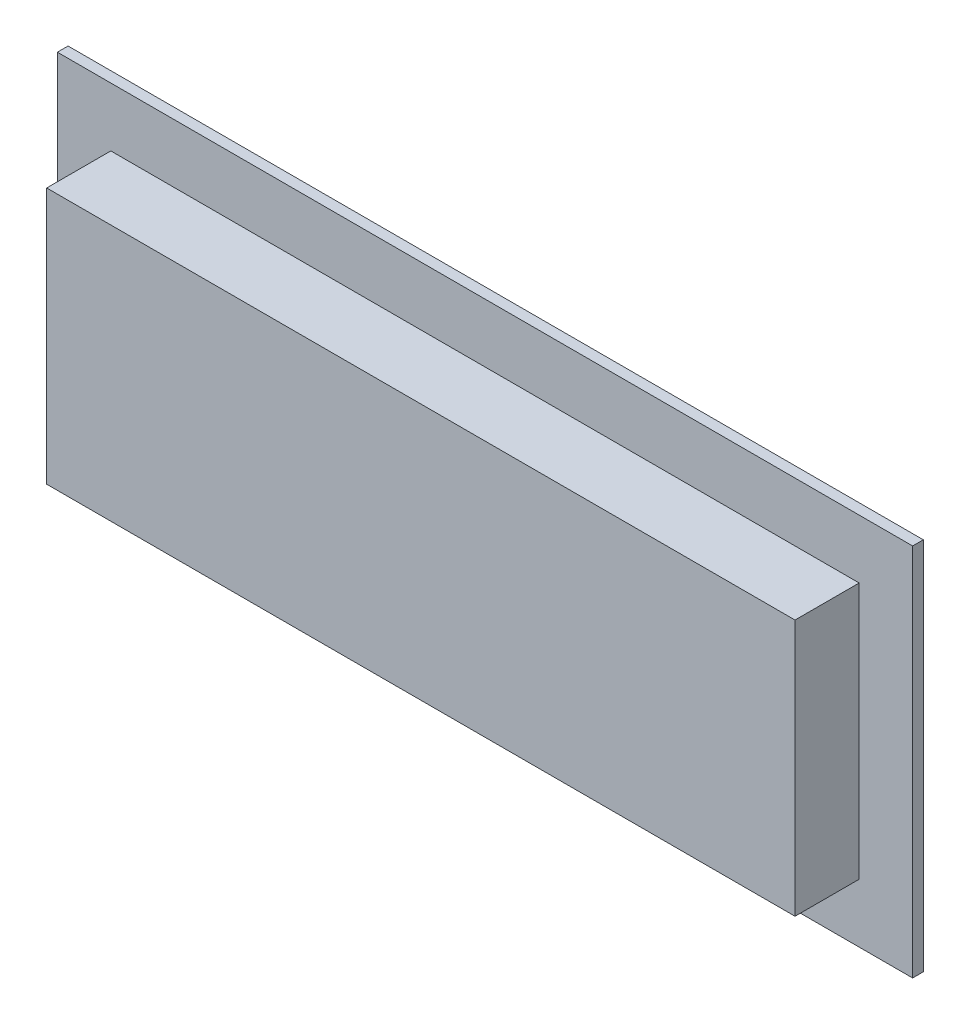
ISO-10303-21;
HEADER;
FILE_DESCRIPTION(('STEP AP214'),'2;1');
FILE_NAME('part.step','',(''),(''),'','','');
FILE_SCHEMA(('AUTOMOTIVE_DESIGN { 1 0 10303 214 1 1 1 1 }'));
ENDSEC;
DATA;
#1=APPLICATION_CONTEXT('core data for automotive mechanical design processes');
#2=APPLICATION_PROTOCOL_DEFINITION('international standard','automotive_design',2000,#1);
#3=PRODUCT_CONTEXT('',#1,'mechanical');
#4=PRODUCT('Part','Part','',(#3));
#5=PRODUCT_RELATED_PRODUCT_CATEGORY('part','',(#4));
#6=PRODUCT_DEFINITION_FORMATION('','',#4);
#7=PRODUCT_DEFINITION_CONTEXT('part definition',#1,'design');
#8=PRODUCT_DEFINITION('design','',#6,#7);
#9=PRODUCT_DEFINITION_SHAPE('','',#8);
#10=(LENGTH_UNIT() NAMED_UNIT(*) SI_UNIT(.MILLI.,.METRE.));
#11=(NAMED_UNIT(*) PLANE_ANGLE_UNIT() SI_UNIT($,.RADIAN.));
#12=(NAMED_UNIT(*) SI_UNIT($,.STERADIAN.) SOLID_ANGLE_UNIT());
#13=UNCERTAINTY_MEASURE_WITH_UNIT(LENGTH_MEASURE(1.E-05),#10,'distance_accuracy_value','');
#14=(GEOMETRIC_REPRESENTATION_CONTEXT(3) GLOBAL_UNCERTAINTY_ASSIGNED_CONTEXT((#13)) GLOBAL_UNIT_ASSIGNED_CONTEXT((#10,
#11,#12)) REPRESENTATION_CONTEXT('',''));
#15=CARTESIAN_POINT('',(0.,0.,0.));
#16=DIRECTION('',(0.,0.,1.));
#17=DIRECTION('',(1.,0.,0.));
#18=AXIS2_PLACEMENT_3D('',#15,#16,#17);
#19=CARTESIAN_POINT('',(0.,0.,-3.));
#20=DIRECTION('',(0.,0.,1.));
#21=DIRECTION('',(1.,0.,0.));
#22=AXIS2_PLACEMENT_3D('',#19,#20,#21);
#23=PLANE('',#22);
#24=DIRECTION('',(0.,1.,0.));
#25=VECTOR('',#24,1.);
#26=CARTESIAN_POINT('',(-8.4193619583301,0.,-3.));
#27=LINE('',#26,#25);
#28=CARTESIAN_POINT('',(-8.4193619583301,-14.8614495173554,-3.));
#29=VERTEX_POINT('',#28);
#30=CARTESIAN_POINT('',(-8.4193619583301,0.,-3.));
#31=VERTEX_POINT('',#30);
#32=EDGE_CURVE('E209',#29,#31,#27,.T.);
#33=ORIENTED_EDGE('',*,*,#32,.T.);
#34=DIRECTION('',(1.,0.,0.));
#35=VECTOR('',#34,1.);
#36=CARTESIAN_POINT('',(-8.4193619583301,0.,-3.));
#37=LINE('',#36,#35);
#38=CARTESIAN_POINT('',(36.228769638875,0.,-3.));
#39=VERTEX_POINT('',#38);
#40=EDGE_CURVE('E212',#31,#39,#37,.T.);
#41=ORIENTED_EDGE('',*,*,#40,.T.);
#42=DIRECTION('',(0.,-1.,0.));
#43=VECTOR('',#42,1.);
#44=CARTESIAN_POINT('',(36.228769638875,0.,-3.));
#45=LINE('',#44,#43);
#46=CARTESIAN_POINT('',(36.228769638875,-14.8614495173554,-3.));
#47=VERTEX_POINT('',#46);
#48=EDGE_CURVE('E215',#39,#47,#45,.T.);
#49=ORIENTED_EDGE('',*,*,#48,.T.);
#50=DIRECTION('',(-1.,0.,0.));
#51=VECTOR('',#50,1.);
#52=CARTESIAN_POINT('',(-8.4193619583301,-14.8614495173554,-3.));
#53=LINE('',#52,#51);
#54=EDGE_CURVE('E217',#47,#29,#53,.T.);
#55=ORIENTED_EDGE('',*,*,#54,.T.);
#56=EDGE_LOOP('',(#33,#41,#49,#55));
#57=FACE_BOUND('',#56,.T.);
#58=DIRECTION('',(0.,1.,0.));
#59=VECTOR('',#58,1.);
#60=CARTESIAN_POINT('',(12.1187785763842,-3.50806748263754,-3.));
#61=LINE('',#60,#59);
#62=CARTESIAN_POINT('',(12.1187785763842,-12.1825616215231,-3.));
#63=VERTEX_POINT('',#62);
#64=CARTESIAN_POINT('',(12.1187785763842,-3.50806748263754,-3.));
#65=VERTEX_POINT('',#64);
#66=EDGE_CURVE('E184',#63,#65,#61,.T.);
#67=ORIENTED_EDGE('',*,*,#66,.F.);
#68=DIRECTION('',(-1.,0.,0.));
#69=VECTOR('',#68,1.);
#70=CARTESIAN_POINT('',(12.1187785763842,-12.1825616215231,-3.));
#71=LINE('',#70,#69);
#72=CARTESIAN_POINT('',(16.0733273749938,-12.1825616215231,-3.));
#73=VERTEX_POINT('',#72);
#74=EDGE_CURVE('E181',#73,#63,#71,.T.);
#75=ORIENTED_EDGE('',*,*,#74,.F.);
#76=DIRECTION('',(0.,-1.,0.));
#77=VECTOR('',#76,1.);
#78=CARTESIAN_POINT('',(16.0733273749938,-3.50806748263754,-3.));
#79=LINE('',#78,#77);
#80=CARTESIAN_POINT('',(16.0733273749938,-3.50806748263754,-3.));
#81=VERTEX_POINT('',#80);
#82=EDGE_CURVE('E59',#81,#73,#79,.T.);
#83=ORIENTED_EDGE('',*,*,#82,.F.);
#84=DIRECTION('',(1.,0.,0.));
#85=VECTOR('',#84,1.);
#86=CARTESIAN_POINT('',(12.1187785763842,-3.50806748263754,-3.));
#87=LINE('',#86,#85);
#88=EDGE_CURVE('E54',#65,#81,#87,.T.);
#89=ORIENTED_EDGE('',*,*,#88,.F.);
#90=EDGE_LOOP('',(#67,#75,#83,#89));
#91=FACE_BOUND('',#90,.T.);
#92=ADVANCED_FACE('F39',(#57,#91),#23,.F.);
#93=CARTESIAN_POINT('',(0.,0.,0.));
#94=DIRECTION('',(0.,0.,-1.));
#95=DIRECTION('',(-1.,0.,0.));
#96=AXIS2_PLACEMENT_3D('',#93,#94,#95);
#97=PLANE('',#96);
#98=DIRECTION('',(1.,0.,0.));
#99=VECTOR('',#98,1.);
#100=CARTESIAN_POINT('',(-40.,-17.5,0.));
#101=LINE('',#100,#99);
#102=CARTESIAN_POINT('',(-40.,-17.5,0.));
#103=VERTEX_POINT('',#102);
#104=CARTESIAN_POINT('',(40.,-17.5,0.));
#105=VERTEX_POINT('',#104);
#106=EDGE_CURVE('E274',#103,#105,#101,.T.);
#107=ORIENTED_EDGE('',*,*,#106,.F.);
#108=DIRECTION('',(0.,-1.,0.));
#109=VECTOR('',#108,1.);
#110=CARTESIAN_POINT('',(-40.,-17.5,0.));
#111=LINE('',#110,#109);
#112=CARTESIAN_POINT('',(-40.,17.5,0.));
#113=VERTEX_POINT('',#112);
#114=EDGE_CURVE('E285',#113,#103,#111,.T.);
#115=ORIENTED_EDGE('',*,*,#114,.F.);
#116=DIRECTION('',(-1.,0.,0.));
#117=VECTOR('',#116,1.);
#118=CARTESIAN_POINT('',(-40.,17.5,0.));
#119=LINE('',#118,#117);
#120=CARTESIAN_POINT('',(40.,17.5,0.));
#121=VERTEX_POINT('',#120);
#122=EDGE_CURVE('E283',#121,#113,#119,.T.);
#123=ORIENTED_EDGE('',*,*,#122,.F.);
#124=DIRECTION('',(0.,1.,0.));
#125=VECTOR('',#124,1.);
#126=CARTESIAN_POINT('',(40.,-17.5,0.));
#127=LINE('',#126,#125);
#128=EDGE_CURVE('E269',#105,#121,#127,.T.);
#129=ORIENTED_EDGE('',*,*,#128,.F.);
#130=EDGE_LOOP('',(#107,#115,#123,#129));
#131=FACE_BOUND('',#130,.T.);
#132=DIRECTION('',(1.,0.,0.));
#133=VECTOR('',#132,1.);
#134=CARTESIAN_POINT('',(-40.,-13.6614495173554,0.));
#135=LINE('',#134,#133);
#136=CARTESIAN_POINT('',(-8.4193619583301,-13.6614495173554,0.));
#137=VERTEX_POINT('',#136);
#138=CARTESIAN_POINT('',(36.228769638875,-13.6614495173554,0.));
#139=VERTEX_POINT('',#138);
#140=EDGE_CURVE('E195',#137,#139,#135,.T.);
#141=ORIENTED_EDGE('',*,*,#140,.F.);
#142=DIRECTION('',(0.,1.,0.));
#143=VECTOR('',#142,1.);
#144=CARTESIAN_POINT('',(-8.4193619583301,0.,0.));
#145=LINE('',#144,#143);
#146=CARTESIAN_POINT('',(-8.4193619583301,-14.8614495173554,0.));
#147=VERTEX_POINT('',#146);
#148=EDGE_CURVE('E208',#147,#137,#145,.T.);
#149=ORIENTED_EDGE('',*,*,#148,.F.);
#150=DIRECTION('',(-1.,0.,0.));
#151=VECTOR('',#150,1.);
#152=CARTESIAN_POINT('',(-8.4193619583301,-14.8614495173554,0.));
#153=LINE('',#152,#151);
#154=CARTESIAN_POINT('',(36.228769638875,-14.8614495173554,0.));
#155=VERTEX_POINT('',#154);
#156=EDGE_CURVE('E213',#155,#147,#153,.T.);
#157=ORIENTED_EDGE('',*,*,#156,.F.);
#158=DIRECTION('',(0.,-1.,0.));
#159=VECTOR('',#158,1.);
#160=CARTESIAN_POINT('',(36.228769638875,0.,0.));
#161=LINE('',#160,#159);
#162=EDGE_CURVE('E222',#139,#155,#161,.T.);
#163=ORIENTED_EDGE('',*,*,#162,.F.);
#164=EDGE_LOOP('',(#141,#149,#157,#163));
#165=FACE_BOUND('',#164,.T.);
#166=ADVANCED_FACE('F302',(#131,#165),#97,.T.);
#167=CARTESIAN_POINT('',(0.,0.,1.));
#168=DIRECTION('',(0.,0.,-1.));
#169=DIRECTION('',(-1.,0.,0.));
#170=AXIS2_PLACEMENT_3D('',#167,#168,#169);
#171=PLANE('',#170);
#172=DIRECTION('',(0.,1.,0.));
#173=VECTOR('',#172,1.);
#174=CARTESIAN_POINT('',(40.,-17.5,1.));
#175=LINE('',#174,#173);
#176=CARTESIAN_POINT('',(40.,-17.5,1.));
#177=VERTEX_POINT('',#176);
#178=CARTESIAN_POINT('',(40.,17.5,1.));
#179=VERTEX_POINT('',#178);
#180=EDGE_CURVE('E270',#177,#179,#175,.T.);
#181=ORIENTED_EDGE('',*,*,#180,.T.);
#182=DIRECTION('',(-1.,0.,0.));
#183=VECTOR('',#182,1.);
#184=CARTESIAN_POINT('',(-40.,17.5,1.));
#185=LINE('',#184,#183);
#186=CARTESIAN_POINT('',(-40.,17.5,1.));
#187=VERTEX_POINT('',#186);
#188=EDGE_CURVE('E273',#179,#187,#185,.T.);
#189=ORIENTED_EDGE('',*,*,#188,.T.);
#190=DIRECTION('',(0.,-1.,0.));
#191=VECTOR('',#190,1.);
#192=CARTESIAN_POINT('',(-40.,-17.5,1.));
#193=LINE('',#192,#191);
#194=CARTESIAN_POINT('',(-40.,-17.5,1.));
#195=VERTEX_POINT('',#194);
#196=EDGE_CURVE('E276',#187,#195,#193,.T.);
#197=ORIENTED_EDGE('',*,*,#196,.T.);
#198=DIRECTION('',(1.,0.,0.));
#199=VECTOR('',#198,1.);
#200=CARTESIAN_POINT('',(-40.,-17.5,1.));
#201=LINE('',#200,#199);
#202=EDGE_CURVE('E278',#195,#177,#201,.T.);
#203=ORIENTED_EDGE('',*,*,#202,.T.);
#204=EDGE_LOOP('',(#181,#189,#197,#203));
#205=FACE_BOUND('',#204,.T.);
#206=DIRECTION('',(0.,1.,0.));
#207=VECTOR('',#206,1.);
#208=CARTESIAN_POINT('',(35.,12.,1.));
#209=LINE('',#208,#207);
#210=CARTESIAN_POINT('',(35.,-12.,1.));
#211=VERTEX_POINT('',#210);
#212=CARTESIAN_POINT('',(35.,12.,1.));
#213=VERTEX_POINT('',#212);
#214=EDGE_CURVE('E236',#211,#213,#209,.T.);
#215=ORIENTED_EDGE('',*,*,#214,.F.);
#216=DIRECTION('',(1.,0.,0.));
#217=VECTOR('',#216,1.);
#218=CARTESIAN_POINT('',(-35.,-12.,1.));
#219=LINE('',#218,#217);
#220=CARTESIAN_POINT('',(-35.,-12.,1.));
#221=VERTEX_POINT('',#220);
#222=EDGE_CURVE('E241',#221,#211,#219,.T.);
#223=ORIENTED_EDGE('',*,*,#222,.F.);
#224=DIRECTION('',(0.,-1.,0.));
#225=VECTOR('',#224,1.);
#226=CARTESIAN_POINT('',(-35.,12.,1.));
#227=LINE('',#226,#225);
#228=CARTESIAN_POINT('',(-35.,12.,1.));
#229=VERTEX_POINT('',#228);
#230=EDGE_CURVE('E253',#229,#221,#227,.T.);
#231=ORIENTED_EDGE('',*,*,#230,.F.);
#232=DIRECTION('',(-1.,0.,0.));
#233=VECTOR('',#232,1.);
#234=CARTESIAN_POINT('',(-35.,12.,1.));
#235=LINE('',#234,#233);
#236=EDGE_CURVE('E250',#213,#229,#235,.T.);
#237=ORIENTED_EDGE('',*,*,#236,.F.);
#238=EDGE_LOOP('',(#215,#223,#231,#237));
#239=FACE_BOUND('',#238,.T.);
#240=ADVANCED_FACE('F313',(#205,#239),#171,.F.);
#241=CARTESIAN_POINT('',(40.,-17.5,1.));
#242=DIRECTION('',(-1.,0.,0.));
#243=DIRECTION('',(0.,0.,1.));
#244=AXIS2_PLACEMENT_3D('',#241,#242,#243);
#245=PLANE('',#244);
#246=ORIENTED_EDGE('',*,*,#128,.T.);
#247=DIRECTION('',(0.,0.,-1.));
#248=VECTOR('',#247,1.);
#249=CARTESIAN_POINT('',(40.,17.5,1.));
#250=LINE('',#249,#248);
#251=EDGE_CURVE('E11',#179,#121,#250,.T.);
#252=ORIENTED_EDGE('',*,*,#251,.F.);
#253=ORIENTED_EDGE('',*,*,#180,.F.);
#254=DIRECTION('',(0.,0.,-1.));
#255=VECTOR('',#254,1.);
#256=CARTESIAN_POINT('',(40.,-17.5,1.));
#257=LINE('',#256,#255);
#258=EDGE_CURVE('E280',#177,#105,#257,.T.);
#259=ORIENTED_EDGE('',*,*,#258,.T.);
#260=EDGE_LOOP('',(#246,#252,#253,#259));
#261=FACE_BOUND('',#260,.T.);
#262=ADVANCED_FACE('F41',(#261),#245,.F.);
#263=CARTESIAN_POINT('',(-40.,17.5,1.));
#264=DIRECTION('',(0.,-1.,0.));
#265=DIRECTION('',(0.,0.,-1.));
#266=AXIS2_PLACEMENT_3D('',#263,#264,#265);
#267=PLANE('',#266);
#268=ORIENTED_EDGE('',*,*,#122,.T.);
#269=DIRECTION('',(0.,0.,-1.));
#270=VECTOR('',#269,1.);
#271=CARTESIAN_POINT('',(-40.,17.5,1.));
#272=LINE('',#271,#270);
#273=EDGE_CURVE('E47',#187,#113,#272,.T.);
#274=ORIENTED_EDGE('',*,*,#273,.F.);
#275=ORIENTED_EDGE('',*,*,#188,.F.);
#276=ORIENTED_EDGE('',*,*,#251,.T.);
#277=EDGE_LOOP('',(#268,#274,#275,#276));
#278=FACE_BOUND('',#277,.T.);
#279=ADVANCED_FACE('F315',(#278),#267,.F.);
#280=CARTESIAN_POINT('',(-40.,-17.5,1.));
#281=DIRECTION('',(1.,0.,0.));
#282=DIRECTION('',(0.,0.,-1.));
#283=AXIS2_PLACEMENT_3D('',#280,#281,#282);
#284=PLANE('',#283);
#285=ORIENTED_EDGE('',*,*,#114,.T.);
#286=DIRECTION('',(0.,0.,-1.));
#287=VECTOR('',#286,1.);
#288=CARTESIAN_POINT('',(-40.,-17.5,1.));
#289=LINE('',#288,#287);
#290=EDGE_CURVE('E290',#195,#103,#289,.T.);
#291=ORIENTED_EDGE('',*,*,#290,.F.);
#292=ORIENTED_EDGE('',*,*,#196,.F.);
#293=ORIENTED_EDGE('',*,*,#273,.T.);
#294=EDGE_LOOP('',(#285,#291,#292,#293));
#295=FACE_BOUND('',#294,.T.);
#296=ADVANCED_FACE('F297',(#295),#284,.F.);
#297=CARTESIAN_POINT('',(-40.,-17.5,1.));
#298=DIRECTION('',(0.,1.,0.));
#299=DIRECTION('',(0.,0.,1.));
#300=AXIS2_PLACEMENT_3D('',#297,#298,#299);
#301=PLANE('',#300);
#302=ORIENTED_EDGE('',*,*,#106,.T.);
#303=ORIENTED_EDGE('',*,*,#258,.F.);
#304=ORIENTED_EDGE('',*,*,#202,.F.);
#305=ORIENTED_EDGE('',*,*,#290,.T.);
#306=EDGE_LOOP('',(#302,#303,#304,#305));
#307=FACE_BOUND('',#306,.T.);
#308=ADVANCED_FACE('F307',(#307),#301,.F.);
#309=CARTESIAN_POINT('',(35.,12.,7.));
#310=DIRECTION('',(-1.,0.,0.));
#311=DIRECTION('',(0.,0.,1.));
#312=AXIS2_PLACEMENT_3D('',#309,#310,#311);
#313=PLANE('',#312);
#314=ORIENTED_EDGE('',*,*,#214,.T.);
#315=DIRECTION('',(0.,0.,-1.));
#316=VECTOR('',#315,1.);
#317=CARTESIAN_POINT('',(35.,12.,7.));
#318=LINE('',#317,#316);
#319=CARTESIAN_POINT('',(35.,12.,7.));
#320=VERTEX_POINT('',#319);
#321=EDGE_CURVE('E266',#320,#213,#318,.T.);
#322=ORIENTED_EDGE('',*,*,#321,.F.);
#323=DIRECTION('',(0.,1.,0.));
#324=VECTOR('',#323,1.);
#325=CARTESIAN_POINT('',(35.,12.,7.));
#326=LINE('',#325,#324);
#327=CARTESIAN_POINT('',(35.,-12.,7.));
#328=VERTEX_POINT('',#327);
#329=EDGE_CURVE('E237',#328,#320,#326,.T.);
#330=ORIENTED_EDGE('',*,*,#329,.F.);
#331=DIRECTION('',(0.,0.,-1.));
#332=VECTOR('',#331,1.);
#333=CARTESIAN_POINT('',(35.,-12.,7.));
#334=LINE('',#333,#332);
#335=EDGE_CURVE('E247',#328,#211,#334,.T.);
#336=ORIENTED_EDGE('',*,*,#335,.T.);
#337=EDGE_LOOP('',(#314,#322,#330,#336));
#338=FACE_BOUND('',#337,.T.);
#339=ADVANCED_FACE('F365',(#338),#313,.F.);
#340=CARTESIAN_POINT('',(-35.,12.,7.));
#341=DIRECTION('',(0.,-1.,0.));
#342=DIRECTION('',(0.,0.,-1.));
#343=AXIS2_PLACEMENT_3D('',#340,#341,#342);
#344=PLANE('',#343);
#345=ORIENTED_EDGE('',*,*,#236,.T.);
#346=DIRECTION('',(0.,0.,-1.));
#347=VECTOR('',#346,1.);
#348=CARTESIAN_POINT('',(-35.,12.,7.));
#349=LINE('',#348,#347);
#350=CARTESIAN_POINT('',(-35.,12.,7.));
#351=VERTEX_POINT('',#350);
#352=EDGE_CURVE('E263',#351,#229,#349,.T.);
#353=ORIENTED_EDGE('',*,*,#352,.F.);
#354=DIRECTION('',(-1.,0.,0.));
#355=VECTOR('',#354,1.);
#356=CARTESIAN_POINT('',(-35.,12.,7.));
#357=LINE('',#356,#355);
#358=EDGE_CURVE('E240',#320,#351,#357,.T.);
#359=ORIENTED_EDGE('',*,*,#358,.F.);
#360=ORIENTED_EDGE('',*,*,#321,.T.);
#361=EDGE_LOOP('',(#345,#353,#359,#360));
#362=FACE_BOUND('',#361,.T.);
#363=ADVANCED_FACE('F361',(#362),#344,.F.);
#364=CARTESIAN_POINT('',(-35.,12.,7.));
#365=DIRECTION('',(1.,0.,0.));
#366=DIRECTION('',(0.,0.,-1.));
#367=AXIS2_PLACEMENT_3D('',#364,#365,#366);
#368=PLANE('',#367);
#369=ORIENTED_EDGE('',*,*,#230,.T.);
#370=DIRECTION('',(0.,0.,-1.));
#371=VECTOR('',#370,1.);
#372=CARTESIAN_POINT('',(-35.,-12.,7.));
#373=LINE('',#372,#371);
#374=CARTESIAN_POINT('',(-35.,-12.,7.));
#375=VERTEX_POINT('',#374);
#376=EDGE_CURVE('E260',#375,#221,#373,.T.);
#377=ORIENTED_EDGE('',*,*,#376,.F.);
#378=DIRECTION('',(0.,-1.,0.));
#379=VECTOR('',#378,1.);
#380=CARTESIAN_POINT('',(-35.,12.,7.));
#381=LINE('',#380,#379);
#382=EDGE_CURVE('E243',#351,#375,#381,.T.);
#383=ORIENTED_EDGE('',*,*,#382,.F.);
#384=ORIENTED_EDGE('',*,*,#352,.T.);
#385=EDGE_LOOP('',(#369,#377,#383,#384));
#386=FACE_BOUND('',#385,.T.);
#387=ADVANCED_FACE('F357',(#386),#368,.F.);
#388=CARTESIAN_POINT('',(-35.,-12.,7.));
#389=DIRECTION('',(0.,1.,0.));
#390=DIRECTION('',(0.,0.,1.));
#391=AXIS2_PLACEMENT_3D('',#388,#389,#390);
#392=PLANE('',#391);
#393=ORIENTED_EDGE('',*,*,#222,.T.);
#394=ORIENTED_EDGE('',*,*,#335,.F.);
#395=DIRECTION('',(1.,0.,0.));
#396=VECTOR('',#395,1.);
#397=CARTESIAN_POINT('',(-35.,-12.,7.));
#398=LINE('',#397,#396);
#399=EDGE_CURVE('E245',#375,#328,#398,.T.);
#400=ORIENTED_EDGE('',*,*,#399,.F.);
#401=ORIENTED_EDGE('',*,*,#376,.T.);
#402=EDGE_LOOP('',(#393,#394,#400,#401));
#403=FACE_BOUND('',#402,.T.);
#404=ADVANCED_FACE('F353',(#403),#392,.F.);
#405=CARTESIAN_POINT('',(0.,0.,7.));
#406=DIRECTION('',(0.,0.,1.));
#407=DIRECTION('',(1.,0.,0.));
#408=AXIS2_PLACEMENT_3D('',#405,#406,#407);
#409=PLANE('',#408);
#410=ORIENTED_EDGE('',*,*,#329,.T.);
#411=ORIENTED_EDGE('',*,*,#358,.T.);
#412=ORIENTED_EDGE('',*,*,#382,.T.);
#413=ORIENTED_EDGE('',*,*,#399,.T.);
#414=EDGE_LOOP('',(#410,#411,#412,#413));
#415=FACE_BOUND('',#414,.T.);
#416=ADVANCED_FACE('F349',(#415),#409,.T.);
#417=CARTESIAN_POINT('',(-8.4193619583301,0.,-3.));
#418=DIRECTION('',(1.,0.,0.));
#419=DIRECTION('',(0.,0.,-1.));
#420=AXIS2_PLACEMENT_3D('',#417,#418,#419);
#421=PLANE('',#420);
#422=DIRECTION('',(0.,0.,-1.));
#423=VECTOR('',#422,1.);
#424=CARTESIAN_POINT('',(-8.4193619583301,-13.6614495173554,-3.));
#425=LINE('',#424,#423);
#426=CARTESIAN_POINT('',(-8.4193619583301,-13.6614495173554,-2.));
#427=VERTEX_POINT('',#426);
#428=EDGE_CURVE('E198',#137,#427,#425,.T.);
#429=ORIENTED_EDGE('',*,*,#428,.T.);
#430=DIRECTION('',(0.,1.,0.));
#431=VECTOR('',#430,1.);
#432=CARTESIAN_POINT('',(-8.4193619583301,0.,-2.));
#433=LINE('',#432,#431);
#434=CARTESIAN_POINT('',(-8.4193619583301,0.,-2.));
#435=VERTEX_POINT('',#434);
#436=EDGE_CURVE('E205',#427,#435,#433,.T.);
#437=ORIENTED_EDGE('',*,*,#436,.T.);
#438=DIRECTION('',(0.,0.,1.));
#439=VECTOR('',#438,1.);
#440=CARTESIAN_POINT('',(-8.4193619583301,0.,-3.));
#441=LINE('',#440,#439);
#442=EDGE_CURVE('E233',#31,#435,#441,.T.);
#443=ORIENTED_EDGE('',*,*,#442,.F.);
#444=ORIENTED_EDGE('',*,*,#32,.F.);
#445=DIRECTION('',(0.,0.,1.));
#446=VECTOR('',#445,1.);
#447=CARTESIAN_POINT('',(-8.4193619583301,-14.8614495173554,-3.));
#448=LINE('',#447,#446);
#449=EDGE_CURVE('E219',#29,#147,#448,.T.);
#450=ORIENTED_EDGE('',*,*,#449,.T.);
#451=ORIENTED_EDGE('',*,*,#148,.T.);
#452=EDGE_LOOP('',(#429,#437,#443,#444,#450,#451));
#453=FACE_BOUND('',#452,.T.);
#454=ADVANCED_FACE('F345',(#453),#421,.F.);
#455=CARTESIAN_POINT('',(-8.4193619583301,0.,-3.));
#456=DIRECTION('',(0.,-1.,0.));
#457=DIRECTION('',(0.,0.,-1.));
#458=AXIS2_PLACEMENT_3D('',#455,#456,#457);
#459=PLANE('',#458);
#460=ORIENTED_EDGE('',*,*,#442,.T.);
#461=DIRECTION('',(1.,0.,0.));
#462=VECTOR('',#461,1.);
#463=CARTESIAN_POINT('',(-8.4193619583301,0.,-2.));
#464=LINE('',#463,#462);
#465=CARTESIAN_POINT('',(36.228769638875,0.,-2.));
#466=VERTEX_POINT('',#465);
#467=EDGE_CURVE('E202',#435,#466,#464,.T.);
#468=ORIENTED_EDGE('',*,*,#467,.T.);
#469=DIRECTION('',(0.,0.,1.));
#470=VECTOR('',#469,1.);
#471=CARTESIAN_POINT('',(36.228769638875,0.,-3.));
#472=LINE('',#471,#470);
#473=EDGE_CURVE('E230',#39,#466,#472,.T.);
#474=ORIENTED_EDGE('',*,*,#473,.F.);
#475=ORIENTED_EDGE('',*,*,#40,.F.);
#476=EDGE_LOOP('',(#460,#468,#474,#475));
#477=FACE_BOUND('',#476,.T.);
#478=ADVANCED_FACE('F341',(#477),#459,.F.);
#479=CARTESIAN_POINT('',(36.228769638875,0.,-3.));
#480=DIRECTION('',(-1.,0.,0.));
#481=DIRECTION('',(0.,0.,1.));
#482=AXIS2_PLACEMENT_3D('',#479,#480,#481);
#483=PLANE('',#482);
#484=ORIENTED_EDGE('',*,*,#473,.T.);
#485=DIRECTION('',(0.,1.,0.));
#486=VECTOR('',#485,1.);
#487=CARTESIAN_POINT('',(36.228769638875,-13.6614495173554,-2.));
#488=LINE('',#487,#486);
#489=CARTESIAN_POINT('',(36.228769638875,-13.6614495173554,-2.));
#490=VERTEX_POINT('',#489);
#491=EDGE_CURVE('E188',#490,#466,#488,.T.);
#492=ORIENTED_EDGE('',*,*,#491,.F.);
#493=DIRECTION('',(0.,0.,-1.));
#494=VECTOR('',#493,1.);
#495=CARTESIAN_POINT('',(36.228769638875,-13.6614495173554,0.));
#496=LINE('',#495,#494);
#497=EDGE_CURVE('E185',#139,#490,#496,.T.);
#498=ORIENTED_EDGE('',*,*,#497,.F.);
#499=ORIENTED_EDGE('',*,*,#162,.T.);
#500=DIRECTION('',(0.,0.,1.));
#501=VECTOR('',#500,1.);
#502=CARTESIAN_POINT('',(36.228769638875,-14.8614495173554,-3.));
#503=LINE('',#502,#501);
#504=EDGE_CURVE('E227',#47,#155,#503,.T.);
#505=ORIENTED_EDGE('',*,*,#504,.F.);
#506=ORIENTED_EDGE('',*,*,#48,.F.);
#507=EDGE_LOOP('',(#484,#492,#498,#499,#505,#506));
#508=FACE_BOUND('',#507,.T.);
#509=ADVANCED_FACE('F337',(#508),#483,.F.);
#510=CARTESIAN_POINT('',(-8.4193619583301,-14.8614495173554,-3.));
#511=DIRECTION('',(0.,1.,0.));
#512=DIRECTION('',(0.,0.,1.));
#513=AXIS2_PLACEMENT_3D('',#510,#511,#512);
#514=PLANE('',#513);
#515=ORIENTED_EDGE('',*,*,#156,.T.);
#516=ORIENTED_EDGE('',*,*,#449,.F.);
#517=ORIENTED_EDGE('',*,*,#54,.F.);
#518=ORIENTED_EDGE('',*,*,#504,.T.);
#519=EDGE_LOOP('',(#515,#516,#517,#518));
#520=FACE_BOUND('',#519,.T.);
#521=ADVANCED_FACE('F333',(#520),#514,.F.);
#522=CARTESIAN_POINT('',(-40.,-13.6614495173554,-2.));
#523=DIRECTION('',(0.,0.,-1.));
#524=DIRECTION('',(-1.,0.,0.));
#525=AXIS2_PLACEMENT_3D('',#522,#523,#524);
#526=PLANE('',#525);
#527=DIRECTION('',(1.,0.,0.));
#528=VECTOR('',#527,1.);
#529=CARTESIAN_POINT('',(-40.,-13.6614495173554,-2.));
#530=LINE('',#529,#528);
#531=EDGE_CURVE('E196',#427,#490,#530,.T.);
#532=ORIENTED_EDGE('',*,*,#531,.T.);
#533=ORIENTED_EDGE('',*,*,#491,.T.);
#534=ORIENTED_EDGE('',*,*,#467,.F.);
#535=ORIENTED_EDGE('',*,*,#436,.F.);
#536=EDGE_LOOP('',(#532,#533,#534,#535));
#537=FACE_BOUND('',#536,.T.);
#538=ADVANCED_FACE('F336',(#537),#526,.F.);
#539=CARTESIAN_POINT('',(-40.,-13.6614495173554,0.));
#540=DIRECTION('',(0.,-1.,0.));
#541=DIRECTION('',(0.,0.,-1.));
#542=AXIS2_PLACEMENT_3D('',#539,#540,#541);
#543=PLANE('',#542);
#544=ORIENTED_EDGE('',*,*,#140,.T.);
#545=ORIENTED_EDGE('',*,*,#497,.T.);
#546=ORIENTED_EDGE('',*,*,#531,.F.);
#547=ORIENTED_EDGE('',*,*,#428,.F.);
#548=EDGE_LOOP('',(#544,#545,#546,#547));
#549=FACE_BOUND('',#548,.T.);
#550=ADVANCED_FACE('F331',(#549),#543,.F.);
#551=CARTESIAN_POINT('',(12.1187785763842,-3.50806748263754,-4.));
#552=DIRECTION('',(1.,0.,0.));
#553=DIRECTION('',(0.,0.,-1.));
#554=AXIS2_PLACEMENT_3D('',#551,#552,#553);
#555=PLANE('',#554);
#556=ORIENTED_EDGE('',*,*,#66,.T.);
#557=DIRECTION('',(0.,0.,1.));
#558=VECTOR('',#557,1.);
#559=CARTESIAN_POINT('',(12.1187785763842,-3.50806748263754,-4.));
#560=LINE('',#559,#558);
#561=CARTESIAN_POINT('',(12.1187785763842,-3.50806748263754,-4.));
#562=VERTEX_POINT('',#561);
#563=EDGE_CURVE('E165',#562,#65,#560,.T.);
#564=ORIENTED_EDGE('',*,*,#563,.F.);
#565=DIRECTION('',(0.,1.,0.));
#566=VECTOR('',#565,1.);
#567=CARTESIAN_POINT('',(12.1187785763842,-3.50806748263754,-4.));
#568=LINE('',#567,#566);
#569=CARTESIAN_POINT('',(12.1187785763842,-12.1825616215231,-4.));
#570=VERTEX_POINT('',#569);
#571=EDGE_CURVE('E172',#570,#562,#568,.T.);
#572=ORIENTED_EDGE('',*,*,#571,.F.);
#573=DIRECTION('',(0.,0.,1.));
#574=VECTOR('',#573,1.);
#575=CARTESIAN_POINT('',(12.1187785763842,-12.1825616215231,-4.));
#576=LINE('',#575,#574);
#577=EDGE_CURVE('E546',#570,#63,#576,.T.);
#578=ORIENTED_EDGE('',*,*,#577,.T.);
#579=EDGE_LOOP('',(#556,#564,#572,#578));
#580=FACE_BOUND('',#579,.T.);
#581=ADVANCED_FACE('F183',(#580),#555,.F.);
#582=CARTESIAN_POINT('',(12.1187785763842,-3.50806748263754,-4.));
#583=DIRECTION('',(0.,-1.,0.));
#584=DIRECTION('',(0.,0.,-1.));
#585=AXIS2_PLACEMENT_3D('',#582,#583,#584);
#586=PLANE('',#585);
#587=ORIENTED_EDGE('',*,*,#88,.T.);
#588=DIRECTION('',(0.,0.,1.));
#589=VECTOR('',#588,1.);
#590=CARTESIAN_POINT('',(16.0733273749938,-3.50806748263754,-4.));
#591=LINE('',#590,#589);
#592=CARTESIAN_POINT('',(16.0733273749938,-3.50806748263754,-4.));
#593=VERTEX_POINT('',#592);
#594=EDGE_CURVE('E168',#593,#81,#591,.T.);
#595=ORIENTED_EDGE('',*,*,#594,.F.);
#596=DIRECTION('',(1.,0.,0.));
#597=VECTOR('',#596,1.);
#598=CARTESIAN_POINT('',(12.1187785763842,-3.50806748263754,-4.));
#599=LINE('',#598,#597);
#600=EDGE_CURVE('E161',#562,#593,#599,.T.);
#601=ORIENTED_EDGE('',*,*,#600,.F.);
#602=ORIENTED_EDGE('',*,*,#563,.T.);
#603=EDGE_LOOP('',(#587,#595,#601,#602));
#604=FACE_BOUND('',#603,.T.);
#605=ADVANCED_FACE('F163',(#604),#586,.F.);
#606=CARTESIAN_POINT('',(16.0733273749938,-3.50806748263754,-4.));
#607=DIRECTION('',(-1.,0.,0.));
#608=DIRECTION('',(0.,0.,1.));
#609=AXIS2_PLACEMENT_3D('',#606,#607,#608);
#610=PLANE('',#609);
#611=ORIENTED_EDGE('',*,*,#82,.T.);
#612=DIRECTION('',(0.,0.,1.));
#613=VECTOR('',#612,1.);
#614=CARTESIAN_POINT('',(16.0733273749938,-12.1825616215231,-4.));
#615=LINE('',#614,#613);
#616=CARTESIAN_POINT('',(16.0733273749938,-12.1825616215231,-4.));
#617=VERTEX_POINT('',#616);
#618=EDGE_CURVE('E190',#617,#73,#615,.T.);
#619=ORIENTED_EDGE('',*,*,#618,.F.);
#620=DIRECTION('',(0.,-1.,0.));
#621=VECTOR('',#620,1.);
#622=CARTESIAN_POINT('',(16.0733273749938,-3.50806748263754,-4.));
#623=LINE('',#622,#621);
#624=EDGE_CURVE('E171',#593,#617,#623,.T.);
#625=ORIENTED_EDGE('',*,*,#624,.F.);
#626=ORIENTED_EDGE('',*,*,#594,.T.);
#627=EDGE_LOOP('',(#611,#619,#625,#626));
#628=FACE_BOUND('',#627,.T.);
#629=ADVANCED_FACE('F440',(#628),#610,.F.);
#630=CARTESIAN_POINT('',(12.1187785763842,-12.1825616215231,-4.));
#631=DIRECTION('',(0.,1.,0.));
#632=DIRECTION('',(0.,0.,1.));
#633=AXIS2_PLACEMENT_3D('',#630,#631,#632);
#634=PLANE('',#633);
#635=ORIENTED_EDGE('',*,*,#74,.T.);
#636=ORIENTED_EDGE('',*,*,#577,.F.);
#637=DIRECTION('',(-1.,0.,0.));
#638=VECTOR('',#637,1.);
#639=CARTESIAN_POINT('',(12.1187785763842,-12.1825616215231,-4.));
#640=LINE('',#639,#638);
#641=EDGE_CURVE('E177',#617,#570,#640,.T.);
#642=ORIENTED_EDGE('',*,*,#641,.F.);
#643=ORIENTED_EDGE('',*,*,#618,.T.);
#644=EDGE_LOOP('',(#635,#636,#642,#643));
#645=FACE_BOUND('',#644,.T.);
#646=ADVANCED_FACE('F447',(#645),#634,.F.);
#647=CARTESIAN_POINT('',(0.,0.,-4.));
#648=DIRECTION('',(0.,0.,1.));
#649=DIRECTION('',(1.,0.,0.));
#650=AXIS2_PLACEMENT_3D('',#647,#648,#649);
#651=PLANE('',#650);
#652=ORIENTED_EDGE('',*,*,#571,.T.);
#653=ORIENTED_EDGE('',*,*,#600,.T.);
#654=ORIENTED_EDGE('',*,*,#624,.T.);
#655=ORIENTED_EDGE('',*,*,#641,.T.);
#656=EDGE_LOOP('',(#652,#653,#654,#655));
#657=FACE_BOUND('',#656,.T.);
#658=ADVANCED_FACE('F175',(#657),#651,.F.);
#659=CLOSED_SHELL('',(#92,#166,#240,#262,#279,#296,#308,#339,#363,#387,#404,#416,#454,#478,#509,
#521,#538,#550,#581,#605,#629,#646,#658));
#660=MANIFOLD_SOLID_BREP('B2',#659);
#661=ADVANCED_BREP_SHAPE_REPRESENTATION('',(#18,#660),#14);
#662=SHAPE_DEFINITION_REPRESENTATION(#9,#661);
ENDSEC;
END-ISO-10303-21;
